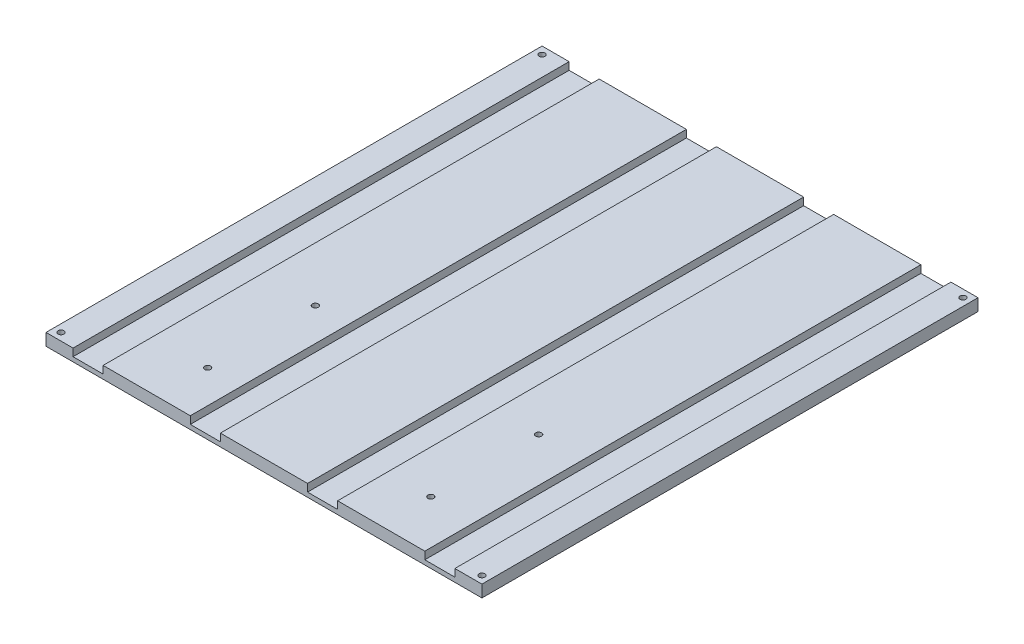
ISO-10303-21;
HEADER;
FILE_DESCRIPTION(('STEP AP214'),'2;1');
FILE_NAME('part.step','',(''),(''),'','','');
FILE_SCHEMA(('AUTOMOTIVE_DESIGN { 1 0 10303 214 1 1 1 1 }'));
ENDSEC;
DATA;
#1=APPLICATION_CONTEXT('core data for automotive mechanical design processes');
#2=APPLICATION_PROTOCOL_DEFINITION('international standard','automotive_design',2000,#1);
#3=PRODUCT_CONTEXT('',#1,'mechanical');
#4=PRODUCT('Part','Part','',(#3));
#5=PRODUCT_RELATED_PRODUCT_CATEGORY('part','',(#4));
#6=PRODUCT_DEFINITION_FORMATION('','',#4);
#7=PRODUCT_DEFINITION_CONTEXT('part definition',#1,'design');
#8=PRODUCT_DEFINITION('design','',#6,#7);
#9=PRODUCT_DEFINITION_SHAPE('','',#8);
#10=(LENGTH_UNIT() NAMED_UNIT(*) SI_UNIT(.MILLI.,.METRE.));
#11=(NAMED_UNIT(*) PLANE_ANGLE_UNIT() SI_UNIT($,.RADIAN.));
#12=(NAMED_UNIT(*) SI_UNIT($,.STERADIAN.) SOLID_ANGLE_UNIT());
#13=UNCERTAINTY_MEASURE_WITH_UNIT(LENGTH_MEASURE(1.E-05),#10,'distance_accuracy_value','');
#14=(GEOMETRIC_REPRESENTATION_CONTEXT(3) GLOBAL_UNCERTAINTY_ASSIGNED_CONTEXT((#13)) GLOBAL_UNIT_ASSIGNED_CONTEXT((#10,
#11,#12)) REPRESENTATION_CONTEXT('',''));
#15=CARTESIAN_POINT('',(0.,0.,0.));
#16=DIRECTION('',(0.,0.,1.));
#17=DIRECTION('',(1.,0.,0.));
#18=AXIS2_PLACEMENT_3D('',#15,#16,#17);
#19=CARTESIAN_POINT('',(-72.5,-4.,-82.5));
#20=DIRECTION('',(0.,0.,1.));
#21=DIRECTION('',(1.,0.,0.));
#22=AXIS2_PLACEMENT_3D('',#19,#20,#21);
#23=PLANE('',#22);
#24=DIRECTION('',(1.,0.,0.));
#25=VECTOR('',#24,1.);
#26=CARTESIAN_POINT('',(-63.5,-2.5,-82.5000000000001));
#27=LINE('',#26,#25);
#28=CARTESIAN_POINT('',(-63.5,-2.5,-82.5000000000001));
#29=VERTEX_POINT('',#28);
#30=CARTESIAN_POINT('',(-53.5,-2.5,-82.5000000000001));
#31=VERTEX_POINT('',#30);
#32=EDGE_CURVE('E196',#29,#31,#27,.T.);
#33=ORIENTED_EDGE('',*,*,#32,.T.);
#34=DIRECTION('',(0.,1.,0.));
#35=VECTOR('',#34,1.);
#36=CARTESIAN_POINT('',(-53.5,-2.5,-82.5000000000001));
#37=LINE('',#36,#35);
#38=CARTESIAN_POINT('',(-53.5,0.,-82.5000000000001));
#39=VERTEX_POINT('',#38);
#40=EDGE_CURVE('E178',#31,#39,#37,.T.);
#41=ORIENTED_EDGE('',*,*,#40,.T.);
#42=DIRECTION('',(1.,0.,0.));
#43=VECTOR('',#42,1.);
#44=CARTESIAN_POINT('',(-72.5,0.,-82.5));
#45=LINE('',#44,#43);
#46=CARTESIAN_POINT('',(-24.5,0.,-82.5000000000001));
#47=VERTEX_POINT('',#46);
#48=EDGE_CURVE('E312',#39,#47,#45,.T.);
#49=ORIENTED_EDGE('',*,*,#48,.T.);
#50=DIRECTION('',(0.,1.,0.));
#51=VECTOR('',#50,1.);
#52=CARTESIAN_POINT('',(-24.5,-2.5,-82.5000000000001));
#53=LINE('',#52,#51);
#54=CARTESIAN_POINT('',(-24.5,-2.5,-82.5000000000001));
#55=VERTEX_POINT('',#54);
#56=EDGE_CURVE('E228',#55,#47,#53,.T.);
#57=ORIENTED_EDGE('',*,*,#56,.F.);
#58=DIRECTION('',(1.,0.,0.));
#59=VECTOR('',#58,1.);
#60=CARTESIAN_POINT('',(-24.5,-2.5,-82.5000000000001));
#61=LINE('',#60,#59);
#62=CARTESIAN_POINT('',(-14.5,-2.5,-82.5000000000001));
#63=VERTEX_POINT('',#62);
#64=EDGE_CURVE('E240',#55,#63,#61,.T.);
#65=ORIENTED_EDGE('',*,*,#64,.T.);
#66=DIRECTION('',(0.,1.,0.));
#67=VECTOR('',#66,1.);
#68=CARTESIAN_POINT('',(-14.5,-2.5,-82.5000000000001));
#69=LINE('',#68,#67);
#70=CARTESIAN_POINT('',(-14.5,0.,-82.5000000000001));
#71=VERTEX_POINT('',#70);
#72=EDGE_CURVE('E225',#63,#71,#69,.T.);
#73=ORIENTED_EDGE('',*,*,#72,.T.);
#74=CARTESIAN_POINT('',(14.5,0.,-82.5000000000001));
#75=VERTEX_POINT('',#74);
#76=EDGE_CURVE('E413',#71,#75,#45,.T.);
#77=ORIENTED_EDGE('',*,*,#76,.T.);
#78=DIRECTION('',(0.,1.,0.));
#79=VECTOR('',#78,1.);
#80=CARTESIAN_POINT('',(14.5,-2.5,-82.5000000000001));
#81=LINE('',#80,#79);
#82=CARTESIAN_POINT('',(14.5,-2.5,-82.5000000000001));
#83=VERTEX_POINT('',#82);
#84=EDGE_CURVE('E253',#83,#75,#81,.T.);
#85=ORIENTED_EDGE('',*,*,#84,.F.);
#86=DIRECTION('',(1.,0.,0.));
#87=VECTOR('',#86,1.);
#88=CARTESIAN_POINT('',(14.5,-2.5,-82.5000000000001));
#89=LINE('',#88,#87);
#90=CARTESIAN_POINT('',(24.5,-2.5,-82.5000000000001));
#91=VERTEX_POINT('',#90);
#92=EDGE_CURVE('E265',#83,#91,#89,.T.);
#93=ORIENTED_EDGE('',*,*,#92,.T.);
#94=DIRECTION('',(0.,1.,0.));
#95=VECTOR('',#94,1.);
#96=CARTESIAN_POINT('',(24.5,-2.5,-82.5000000000001));
#97=LINE('',#96,#95);
#98=CARTESIAN_POINT('',(24.5,0.,-82.5000000000001));
#99=VERTEX_POINT('',#98);
#100=EDGE_CURVE('E250',#91,#99,#97,.T.);
#101=ORIENTED_EDGE('',*,*,#100,.T.);
#102=CARTESIAN_POINT('',(53.5,0.,-82.5000000000001));
#103=VERTEX_POINT('',#102);
#104=EDGE_CURVE('E411',#99,#103,#45,.T.);
#105=ORIENTED_EDGE('',*,*,#104,.T.);
#106=DIRECTION('',(0.,1.,0.));
#107=VECTOR('',#106,1.);
#108=CARTESIAN_POINT('',(53.5,-2.5,-82.5000000000001));
#109=LINE('',#108,#107);
#110=CARTESIAN_POINT('',(53.5,-2.5,-82.5000000000001));
#111=VERTEX_POINT('',#110);
#112=EDGE_CURVE('E278',#111,#103,#109,.T.);
#113=ORIENTED_EDGE('',*,*,#112,.F.);
#114=DIRECTION('',(1.,0.,0.));
#115=VECTOR('',#114,1.);
#116=CARTESIAN_POINT('',(53.5,-2.5,-82.5000000000001));
#117=LINE('',#116,#115);
#118=CARTESIAN_POINT('',(63.5,-2.5,-82.5000000000001));
#119=VERTEX_POINT('',#118);
#120=EDGE_CURVE('E289',#111,#119,#117,.T.);
#121=ORIENTED_EDGE('',*,*,#120,.T.);
#122=DIRECTION('',(0.,1.,0.));
#123=VECTOR('',#122,1.);
#124=CARTESIAN_POINT('',(63.5,-2.5,-82.5000000000001));
#125=LINE('',#124,#123);
#126=CARTESIAN_POINT('',(63.5,0.,-82.5000000000001));
#127=VERTEX_POINT('',#126);
#128=EDGE_CURVE('E275',#119,#127,#125,.T.);
#129=ORIENTED_EDGE('',*,*,#128,.T.);
#130=CARTESIAN_POINT('',(72.5,0.,-82.5));
#131=VERTEX_POINT('',#130);
#132=EDGE_CURVE('E189',#127,#131,#45,.T.);
#133=ORIENTED_EDGE('',*,*,#132,.T.);
#134=DIRECTION('',(0.,1.,0.));
#135=VECTOR('',#134,1.);
#136=CARTESIAN_POINT('',(72.5,-4.,-82.5));
#137=LINE('',#136,#135);
#138=CARTESIAN_POINT('',(72.5,-4.,-82.5));
#139=VERTEX_POINT('',#138);
#140=EDGE_CURVE('E11',#139,#131,#137,.T.);
#141=ORIENTED_EDGE('',*,*,#140,.F.);
#142=DIRECTION('',(1.,0.,0.));
#143=VECTOR('',#142,1.);
#144=CARTESIAN_POINT('',(-72.5,-4.,-82.5));
#145=LINE('',#144,#143);
#146=CARTESIAN_POINT('',(-72.5,-4.,-82.5));
#147=VERTEX_POINT('',#146);
#148=EDGE_CURVE('E297',#147,#139,#145,.T.);
#149=ORIENTED_EDGE('',*,*,#148,.F.);
#150=DIRECTION('',(0.,1.,0.));
#151=VECTOR('',#150,1.);
#152=CARTESIAN_POINT('',(-72.5,-4.,-82.5));
#153=LINE('',#152,#151);
#154=CARTESIAN_POINT('',(-72.5,0.,-82.5));
#155=VERTEX_POINT('',#154);
#156=EDGE_CURVE('E308',#147,#155,#153,.T.);
#157=ORIENTED_EDGE('',*,*,#156,.T.);
#158=CARTESIAN_POINT('',(-63.5,0.,-82.5));
#159=VERTEX_POINT('',#158);
#160=EDGE_CURVE('E309',#155,#159,#45,.T.);
#161=ORIENTED_EDGE('',*,*,#160,.T.);
#162=DIRECTION('',(0.,1.,0.));
#163=VECTOR('',#162,1.);
#164=CARTESIAN_POINT('',(-63.5,-2.5,-82.5000000000001));
#165=LINE('',#164,#163);
#166=EDGE_CURVE('E203',#29,#159,#165,.T.);
#167=ORIENTED_EDGE('',*,*,#166,.F.);
#168=EDGE_LOOP('',(#33,#41,#49,#57,#65,#73,#77,#85,#93,#101,#105,#113,#121,#129,#133,#141,#149,
#157,#161,#167));
#169=FACE_BOUND('',#168,.T.);
#170=ADVANCED_FACE('F41',(#169),#23,.F.);
#171=CARTESIAN_POINT('',(-72.5,-4.,82.5));
#172=DIRECTION('',(0.,0.,1.));
#173=DIRECTION('',(1.,0.,0.));
#174=AXIS2_PLACEMENT_3D('',#171,#172,#173);
#175=PLANE('',#174);
#176=DIRECTION('',(0.,1.,0.));
#177=VECTOR('',#176,1.);
#178=CARTESIAN_POINT('',(-53.5,-2.5,82.4999999999999));
#179=LINE('',#178,#177);
#180=CARTESIAN_POINT('',(-53.5,-2.5,82.4999999999999));
#181=VERTEX_POINT('',#180);
#182=CARTESIAN_POINT('',(-53.5,0.,82.4999999999999));
#183=VERTEX_POINT('',#182);
#184=EDGE_CURVE('E190',#181,#183,#179,.T.);
#185=ORIENTED_EDGE('',*,*,#184,.F.);
#186=DIRECTION('',(1.,0.,0.));
#187=VECTOR('',#186,1.);
#188=CARTESIAN_POINT('',(-63.5,-2.5,82.4999999999999));
#189=LINE('',#188,#187);
#190=CARTESIAN_POINT('',(-63.5,-2.5,82.4999999999999));
#191=VERTEX_POINT('',#190);
#192=EDGE_CURVE('E199',#191,#181,#189,.T.);
#193=ORIENTED_EDGE('',*,*,#192,.F.);
#194=DIRECTION('',(0.,1.,0.));
#195=VECTOR('',#194,1.);
#196=CARTESIAN_POINT('',(-63.5,-2.5,82.4999999999999));
#197=LINE('',#196,#195);
#198=CARTESIAN_POINT('',(-63.5,0.,82.4999999999999));
#199=VERTEX_POINT('',#198);
#200=EDGE_CURVE('E218',#191,#199,#197,.T.);
#201=ORIENTED_EDGE('',*,*,#200,.T.);
#202=DIRECTION('',(1.,0.,0.));
#203=VECTOR('',#202,1.);
#204=CARTESIAN_POINT('',(-72.5,0.,82.5));
#205=LINE('',#204,#203);
#206=CARTESIAN_POINT('',(-72.5,0.,82.5));
#207=VERTEX_POINT('',#206);
#208=EDGE_CURVE('E316',#207,#199,#205,.T.);
#209=ORIENTED_EDGE('',*,*,#208,.F.);
#210=DIRECTION('',(0.,1.,0.));
#211=VECTOR('',#210,1.);
#212=CARTESIAN_POINT('',(-72.5,-4.,82.5));
#213=LINE('',#212,#211);
#214=CARTESIAN_POINT('',(-72.5,-4.,82.5));
#215=VERTEX_POINT('',#214);
#216=EDGE_CURVE('E323',#215,#207,#213,.T.);
#217=ORIENTED_EDGE('',*,*,#216,.F.);
#218=DIRECTION('',(1.,0.,0.));
#219=VECTOR('',#218,1.);
#220=CARTESIAN_POINT('',(-72.5,-4.,82.5));
#221=LINE('',#220,#219);
#222=CARTESIAN_POINT('',(72.5,-4.,82.5));
#223=VERTEX_POINT('',#222);
#224=EDGE_CURVE('E303',#215,#223,#221,.T.);
#225=ORIENTED_EDGE('',*,*,#224,.T.);
#226=DIRECTION('',(0.,1.,0.));
#227=VECTOR('',#226,1.);
#228=CARTESIAN_POINT('',(72.5,-4.,82.5));
#229=LINE('',#228,#227);
#230=CARTESIAN_POINT('',(72.5,0.,82.5));
#231=VERTEX_POINT('',#230);
#232=EDGE_CURVE('E49',#223,#231,#229,.T.);
#233=ORIENTED_EDGE('',*,*,#232,.T.);
#234=CARTESIAN_POINT('',(63.5,0.,82.5));
#235=VERTEX_POINT('',#234);
#236=EDGE_CURVE('E315',#235,#231,#205,.T.);
#237=ORIENTED_EDGE('',*,*,#236,.F.);
#238=DIRECTION('',(0.,1.,0.));
#239=VECTOR('',#238,1.);
#240=CARTESIAN_POINT('',(63.5,-2.5,82.4999999999999));
#241=LINE('',#240,#239);
#242=CARTESIAN_POINT('',(63.5,-2.5,82.4999999999999));
#243=VERTEX_POINT('',#242);
#244=EDGE_CURVE('E57',#243,#235,#241,.T.);
#245=ORIENTED_EDGE('',*,*,#244,.F.);
#246=DIRECTION('',(1.,0.,0.));
#247=VECTOR('',#246,1.);
#248=CARTESIAN_POINT('',(53.5,-2.5,82.4999999999999));
#249=LINE('',#248,#247);
#250=CARTESIAN_POINT('',(53.5,-2.5,82.4999999999999));
#251=VERTEX_POINT('',#250);
#252=EDGE_CURVE('E286',#251,#243,#249,.T.);
#253=ORIENTED_EDGE('',*,*,#252,.F.);
#254=DIRECTION('',(0.,1.,0.));
#255=VECTOR('',#254,1.);
#256=CARTESIAN_POINT('',(53.5,-2.5,82.4999999999999));
#257=LINE('',#256,#255);
#258=CARTESIAN_POINT('',(53.5,0.,82.4999999999999));
#259=VERTEX_POINT('',#258);
#260=EDGE_CURVE('E280',#251,#259,#257,.T.);
#261=ORIENTED_EDGE('',*,*,#260,.T.);
#262=CARTESIAN_POINT('',(24.5,0.,82.5));
#263=VERTEX_POINT('',#262);
#264=EDGE_CURVE('E406',#263,#259,#205,.T.);
#265=ORIENTED_EDGE('',*,*,#264,.F.);
#266=DIRECTION('',(0.,1.,0.));
#267=VECTOR('',#266,1.);
#268=CARTESIAN_POINT('',(24.5,-2.5,82.4999999999999));
#269=LINE('',#268,#267);
#270=CARTESIAN_POINT('',(24.5,-2.5,82.4999999999999));
#271=VERTEX_POINT('',#270);
#272=EDGE_CURVE('E65',#271,#263,#269,.T.);
#273=ORIENTED_EDGE('',*,*,#272,.F.);
#274=DIRECTION('',(1.,0.,0.));
#275=VECTOR('',#274,1.);
#276=CARTESIAN_POINT('',(14.5,-2.5,82.4999999999999));
#277=LINE('',#276,#275);
#278=CARTESIAN_POINT('',(14.5,-2.5,82.4999999999999));
#279=VERTEX_POINT('',#278);
#280=EDGE_CURVE('E262',#279,#271,#277,.T.);
#281=ORIENTED_EDGE('',*,*,#280,.F.);
#282=DIRECTION('',(0.,1.,0.));
#283=VECTOR('',#282,1.);
#284=CARTESIAN_POINT('',(14.5,-2.5,82.4999999999999));
#285=LINE('',#284,#283);
#286=CARTESIAN_POINT('',(14.5,0.,82.4999999999999));
#287=VERTEX_POINT('',#286);
#288=EDGE_CURVE('E255',#279,#287,#285,.T.);
#289=ORIENTED_EDGE('',*,*,#288,.T.);
#290=CARTESIAN_POINT('',(-14.5,0.,82.5));
#291=VERTEX_POINT('',#290);
#292=EDGE_CURVE('E435',#291,#287,#205,.T.);
#293=ORIENTED_EDGE('',*,*,#292,.F.);
#294=DIRECTION('',(0.,1.,0.));
#295=VECTOR('',#294,1.);
#296=CARTESIAN_POINT('',(-14.5,-2.5,82.4999999999999));
#297=LINE('',#296,#295);
#298=CARTESIAN_POINT('',(-14.5,-2.5,82.4999999999999));
#299=VERTEX_POINT('',#298);
#300=EDGE_CURVE('E222',#299,#291,#297,.T.);
#301=ORIENTED_EDGE('',*,*,#300,.F.);
#302=DIRECTION('',(1.,0.,0.));
#303=VECTOR('',#302,1.);
#304=CARTESIAN_POINT('',(-24.5,-2.5,82.4999999999999));
#305=LINE('',#304,#303);
#306=CARTESIAN_POINT('',(-24.5,-2.5,82.4999999999999));
#307=VERTEX_POINT('',#306);
#308=EDGE_CURVE('E237',#307,#299,#305,.T.);
#309=ORIENTED_EDGE('',*,*,#308,.F.);
#310=DIRECTION('',(0.,1.,0.));
#311=VECTOR('',#310,1.);
#312=CARTESIAN_POINT('',(-24.5,-2.5,82.4999999999999));
#313=LINE('',#312,#311);
#314=CARTESIAN_POINT('',(-24.5,0.,82.4999999999999));
#315=VERTEX_POINT('',#314);
#316=EDGE_CURVE('E230',#307,#315,#313,.T.);
#317=ORIENTED_EDGE('',*,*,#316,.T.);
#318=EDGE_CURVE('E319',#183,#315,#205,.T.);
#319=ORIENTED_EDGE('',*,*,#318,.F.);
#320=EDGE_LOOP('',(#185,#193,#201,#209,#217,#225,#233,#237,#245,#253,#261,#265,#273,#281,#289,
#293,#301,#309,#317,#319));
#321=FACE_BOUND('',#320,.T.);
#322=ADVANCED_FACE('F357',(#321),#175,.T.);
#323=CARTESIAN_POINT('',(0.,0.,0.));
#324=DIRECTION('',(0.,1.,0.));
#325=DIRECTION('',(0.,0.,1.));
#326=AXIS2_PLACEMENT_3D('',#323,#324,#325);
#327=PLANE('',#326);
#328=CARTESIAN_POINT('',(-70.,0.,80.));
#329=DIRECTION('',(0.,1.,0.));
#330=DIRECTION('',(0.,0.,1.));
#331=AXIS2_PLACEMENT_3D('',#328,#329,#330);
#332=CIRCLE('',#331,0.97999999999999);
#333=CARTESIAN_POINT('',(-70.,0.,80.98));
#334=VERTEX_POINT('',#333);
#335=EDGE_CURVE('E209',#334,#334,#332,.T.);
#336=ORIENTED_EDGE('',*,*,#335,.F.);
#337=EDGE_LOOP('',(#336));
#338=FACE_BOUND('',#337,.T.);
#339=CARTESIAN_POINT('',(-70.,0.,-80.));
#340=DIRECTION('',(0.,1.,0.));
#341=DIRECTION('',(0.,0.,1.));
#342=AXIS2_PLACEMENT_3D('',#339,#340,#341);
#343=CIRCLE('',#342,0.97999999999999);
#344=CARTESIAN_POINT('',(-70.,0.,-79.02));
#345=VERTEX_POINT('',#344);
#346=EDGE_CURVE('E332',#345,#345,#343,.T.);
#347=ORIENTED_EDGE('',*,*,#346,.F.);
#348=EDGE_LOOP('',(#347));
#349=FACE_BOUND('',#348,.T.);
#350=ORIENTED_EDGE('',*,*,#208,.T.);
#351=DIRECTION('',(0.,0.,-1.));
#352=VECTOR('',#351,1.);
#353=CARTESIAN_POINT('',(-63.5,0.,82.4999999999999));
#354=LINE('',#353,#352);
#355=EDGE_CURVE('E204',#199,#159,#354,.T.);
#356=ORIENTED_EDGE('',*,*,#355,.T.);
#357=ORIENTED_EDGE('',*,*,#160,.F.);
#358=DIRECTION('',(0.,0.,-1.));
#359=VECTOR('',#358,1.);
#360=CARTESIAN_POINT('',(-72.5,0.,82.5));
#361=LINE('',#360,#359);
#362=EDGE_CURVE('E300',#207,#155,#361,.T.);
#363=ORIENTED_EDGE('',*,*,#362,.F.);
#364=EDGE_LOOP('',(#350,#356,#357,#363));
#365=FACE_BOUND('',#364,.T.);
#366=ADVANCED_FACE('F353',(#338,#349,#365),#327,.T.);
#367=CARTESIAN_POINT('',(-35.4387355213286,0.,65.8118093505721));
#368=DIRECTION('',(0.,1.,0.));
#369=DIRECTION('',(0.,0.,1.));
#370=AXIS2_PLACEMENT_3D('',#367,#368,#369);
#371=CIRCLE('',#370,0.980000000000004);
#372=CARTESIAN_POINT('',(-35.4387355213286,0.,66.7918093505721));
#373=VERTEX_POINT('',#372);
#374=EDGE_CURVE('E494',#373,#373,#371,.T.);
#375=ORIENTED_EDGE('',*,*,#374,.F.);
#376=EDGE_LOOP('',(#375));
#377=FACE_BOUND('',#376,.T.);
#378=CARTESIAN_POINT('',(-35.4387355213286,0.,29.9718093505721));
#379=DIRECTION('',(0.,1.,0.));
#380=DIRECTION('',(0.,0.,1.));
#381=AXIS2_PLACEMENT_3D('',#378,#379,#380);
#382=CIRCLE('',#381,0.980000000000012);
#383=CARTESIAN_POINT('',(-35.4387355213286,0.,30.9518093505721));
#384=VERTEX_POINT('',#383);
#385=EDGE_CURVE('E483',#384,#384,#382,.T.);
#386=ORIENTED_EDGE('',*,*,#385,.F.);
#387=EDGE_LOOP('',(#386));
#388=FACE_BOUND('',#387,.T.);
#389=DIRECTION('',(0.,0.,-1.));
#390=VECTOR('',#389,1.);
#391=CARTESIAN_POINT('',(-53.5,0.,82.4999999999999));
#392=LINE('',#391,#390);
#393=EDGE_CURVE('E184',#183,#39,#392,.T.);
#394=ORIENTED_EDGE('',*,*,#393,.F.);
#395=ORIENTED_EDGE('',*,*,#318,.T.);
#396=DIRECTION('',(0.,0.,-1.));
#397=VECTOR('',#396,1.);
#398=CARTESIAN_POINT('',(-24.5,0.,82.4999999999999));
#399=LINE('',#398,#397);
#400=EDGE_CURVE('E234',#315,#47,#399,.T.);
#401=ORIENTED_EDGE('',*,*,#400,.T.);
#402=ORIENTED_EDGE('',*,*,#48,.F.);
#403=EDGE_LOOP('',(#394,#395,#401,#402));
#404=FACE_BOUND('',#403,.T.);
#405=ADVANCED_FACE('F356',(#377,#388,#404),#327,.T.);
#406=DIRECTION('',(0.,0.,-1.));
#407=VECTOR('',#406,1.);
#408=CARTESIAN_POINT('',(-14.5,0.,82.4999999999999));
#409=LINE('',#408,#407);
#410=EDGE_CURVE('E215',#291,#71,#409,.T.);
#411=ORIENTED_EDGE('',*,*,#410,.F.);
#412=ORIENTED_EDGE('',*,*,#292,.T.);
#413=DIRECTION('',(0.,0.,-1.));
#414=VECTOR('',#413,1.);
#415=CARTESIAN_POINT('',(14.5,0.,82.4999999999999));
#416=LINE('',#415,#414);
#417=EDGE_CURVE('E259',#287,#75,#416,.T.);
#418=ORIENTED_EDGE('',*,*,#417,.T.);
#419=ORIENTED_EDGE('',*,*,#76,.F.);
#420=EDGE_LOOP('',(#411,#412,#418,#419));
#421=FACE_BOUND('',#420,.T.);
#422=ADVANCED_FACE('F398',(#421),#327,.T.);
#423=CARTESIAN_POINT('',(38.8312644786714,0.,65.8118093505721));
#424=DIRECTION('',(0.,1.,0.));
#425=DIRECTION('',(0.,0.,1.));
#426=AXIS2_PLACEMENT_3D('',#423,#424,#425);
#427=CIRCLE('',#426,0.979999999999997);
#428=CARTESIAN_POINT('',(38.8312644786714,0.,66.7918093505721));
#429=VERTEX_POINT('',#428);
#430=EDGE_CURVE('E500',#429,#429,#427,.T.);
#431=ORIENTED_EDGE('',*,*,#430,.F.);
#432=EDGE_LOOP('',(#431));
#433=FACE_BOUND('',#432,.T.);
#434=CARTESIAN_POINT('',(38.8312644786714,0.,29.9718093505721));
#435=DIRECTION('',(0.,1.,0.));
#436=DIRECTION('',(0.,0.,1.));
#437=AXIS2_PLACEMENT_3D('',#434,#435,#436);
#438=CIRCLE('',#437,0.979999999999997);
#439=CARTESIAN_POINT('',(38.8312644786714,0.,30.9518093505721));
#440=VERTEX_POINT('',#439);
#441=EDGE_CURVE('E506',#440,#440,#438,.T.);
#442=ORIENTED_EDGE('',*,*,#441,.F.);
#443=EDGE_LOOP('',(#442));
#444=FACE_BOUND('',#443,.T.);
#445=DIRECTION('',(0.,0.,-1.));
#446=VECTOR('',#445,1.);
#447=CARTESIAN_POINT('',(24.5,0.,82.4999999999999));
#448=LINE('',#447,#446);
#449=EDGE_CURVE('E233',#263,#99,#448,.T.);
#450=ORIENTED_EDGE('',*,*,#449,.F.);
#451=ORIENTED_EDGE('',*,*,#264,.T.);
#452=DIRECTION('',(0.,0.,-1.));
#453=VECTOR('',#452,1.);
#454=CARTESIAN_POINT('',(53.5,0.,82.4999999999999));
#455=LINE('',#454,#453);
#456=EDGE_CURVE('E283',#259,#103,#455,.T.);
#457=ORIENTED_EDGE('',*,*,#456,.T.);
#458=ORIENTED_EDGE('',*,*,#104,.F.);
#459=EDGE_LOOP('',(#450,#451,#457,#458));
#460=FACE_BOUND('',#459,.T.);
#461=ADVANCED_FACE('F391',(#433,#444,#460),#327,.T.);
#462=CARTESIAN_POINT('',(72.5,-4.,82.5));
#463=DIRECTION('',(1.,0.,0.));
#464=DIRECTION('',(0.,0.,-1.));
#465=AXIS2_PLACEMENT_3D('',#462,#463,#464);
#466=PLANE('',#465);
#467=DIRECTION('',(0.,0.,-1.));
#468=VECTOR('',#467,1.);
#469=CARTESIAN_POINT('',(72.5,0.,82.5));
#470=LINE('',#469,#468);
#471=EDGE_CURVE('E311',#231,#131,#470,.T.);
#472=ORIENTED_EDGE('',*,*,#471,.F.);
#473=ORIENTED_EDGE('',*,*,#232,.F.);
#474=DIRECTION('',(0.,0.,-1.));
#475=VECTOR('',#474,1.);
#476=CARTESIAN_POINT('',(72.5,-4.,82.5));
#477=LINE('',#476,#475);
#478=EDGE_CURVE('E299',#223,#139,#477,.T.);
#479=ORIENTED_EDGE('',*,*,#478,.T.);
#480=ORIENTED_EDGE('',*,*,#140,.T.);
#481=EDGE_LOOP('',(#472,#473,#479,#480));
#482=FACE_BOUND('',#481,.T.);
#483=ADVANCED_FACE('F389',(#482),#466,.T.);
#484=CARTESIAN_POINT('',(-72.5,-4.,82.5));
#485=DIRECTION('',(1.,0.,0.));
#486=DIRECTION('',(0.,0.,-1.));
#487=AXIS2_PLACEMENT_3D('',#484,#485,#486);
#488=PLANE('',#487);
#489=ORIENTED_EDGE('',*,*,#362,.T.);
#490=ORIENTED_EDGE('',*,*,#156,.F.);
#491=DIRECTION('',(0.,0.,-1.));
#492=VECTOR('',#491,1.);
#493=CARTESIAN_POINT('',(-72.5,-4.,82.5));
#494=LINE('',#493,#492);
#495=EDGE_CURVE('E306',#215,#147,#494,.T.);
#496=ORIENTED_EDGE('',*,*,#495,.F.);
#497=ORIENTED_EDGE('',*,*,#216,.T.);
#498=EDGE_LOOP('',(#489,#490,#496,#497));
#499=FACE_BOUND('',#498,.T.);
#500=ADVANCED_FACE('F388',(#499),#488,.F.);
#501=CARTESIAN_POINT('',(0.,-4.,0.));
#502=DIRECTION('',(0.,1.,0.));
#503=DIRECTION('',(0.,0.,1.));
#504=AXIS2_PLACEMENT_3D('',#501,#502,#503);
#505=PLANE('',#504);
#506=CARTESIAN_POINT('',(-35.4387355213286,-4.,65.8118093505721));
#507=DIRECTION('',(0.,1.,0.));
#508=DIRECTION('',(0.,0.,1.));
#509=AXIS2_PLACEMENT_3D('',#506,#507,#508);
#510=CIRCLE('',#509,0.980000000000004);
#511=CARTESIAN_POINT('',(-35.4387355213286,-4.,66.7918093505721));
#512=VERTEX_POINT('',#511);
#513=EDGE_CURVE('E497',#512,#512,#510,.T.);
#514=ORIENTED_EDGE('',*,*,#513,.T.);
#515=EDGE_LOOP('',(#514));
#516=FACE_BOUND('',#515,.T.);
#517=CARTESIAN_POINT('',(38.8312644786714,-4.,65.8118093505721));
#518=DIRECTION('',(0.,1.,0.));
#519=DIRECTION('',(0.,0.,1.));
#520=AXIS2_PLACEMENT_3D('',#517,#518,#519);
#521=CIRCLE('',#520,0.979999999999997);
#522=CARTESIAN_POINT('',(38.8312644786714,-4.,66.7918093505721));
#523=VERTEX_POINT('',#522);
#524=EDGE_CURVE('E503',#523,#523,#521,.T.);
#525=ORIENTED_EDGE('',*,*,#524,.T.);
#526=EDGE_LOOP('',(#525));
#527=FACE_BOUND('',#526,.T.);
#528=CARTESIAN_POINT('',(38.8312644786714,-4.,29.9718093505721));
#529=DIRECTION('',(0.,1.,0.));
#530=DIRECTION('',(0.,0.,1.));
#531=AXIS2_PLACEMENT_3D('',#528,#529,#530);
#532=CIRCLE('',#531,0.979999999999997);
#533=CARTESIAN_POINT('',(38.8312644786714,-4.,30.9518093505721));
#534=VERTEX_POINT('',#533);
#535=EDGE_CURVE('E491',#534,#534,#532,.T.);
#536=ORIENTED_EDGE('',*,*,#535,.T.);
#537=EDGE_LOOP('',(#536));
#538=FACE_BOUND('',#537,.T.);
#539=CARTESIAN_POINT('',(-35.4387355213286,-4.,29.9718093505721));
#540=DIRECTION('',(0.,1.,0.));
#541=DIRECTION('',(0.,0.,1.));
#542=AXIS2_PLACEMENT_3D('',#539,#540,#541);
#543=CIRCLE('',#542,0.980000000000012);
#544=CARTESIAN_POINT('',(-35.4387355213286,-4.,30.9518093505721));
#545=VERTEX_POINT('',#544);
#546=EDGE_CURVE('E486',#545,#545,#543,.T.);
#547=ORIENTED_EDGE('',*,*,#546,.T.);
#548=EDGE_LOOP('',(#547));
#549=FACE_BOUND('',#548,.T.);
#550=CARTESIAN_POINT('',(70.,-4.,80.));
#551=DIRECTION('',(0.,-1.,0.));
#552=DIRECTION('',(0.,0.,-1.));
#553=AXIS2_PLACEMENT_3D('',#550,#551,#552);
#554=CIRCLE('',#553,0.97999999999999);
#555=CARTESIAN_POINT('',(70.,-4.,79.02));
#556=VERTEX_POINT('',#555);
#557=EDGE_CURVE('E342',#556,#556,#554,.T.);
#558=ORIENTED_EDGE('',*,*,#557,.F.);
#559=EDGE_LOOP('',(#558));
#560=FACE_BOUND('',#559,.T.);
#561=CARTESIAN_POINT('',(-70.,-4.,80.));
#562=DIRECTION('',(0.,-1.,0.));
#563=DIRECTION('',(0.,0.,-1.));
#564=AXIS2_PLACEMENT_3D('',#561,#562,#563);
#565=CIRCLE('',#564,0.97999999999999);
#566=CARTESIAN_POINT('',(-70.,-4.,79.02));
#567=VERTEX_POINT('',#566);
#568=EDGE_CURVE('E339',#567,#567,#565,.T.);
#569=ORIENTED_EDGE('',*,*,#568,.F.);
#570=EDGE_LOOP('',(#569));
#571=FACE_BOUND('',#570,.T.);
#572=CARTESIAN_POINT('',(-70.,-4.,-80.));
#573=DIRECTION('',(0.,-1.,0.));
#574=DIRECTION('',(0.,0.,-1.));
#575=AXIS2_PLACEMENT_3D('',#572,#573,#574);
#576=CIRCLE('',#575,0.97999999999999);
#577=CARTESIAN_POINT('',(-70.,-4.,-80.98));
#578=VERTEX_POINT('',#577);
#579=EDGE_CURVE('E334',#578,#578,#576,.T.);
#580=ORIENTED_EDGE('',*,*,#579,.F.);
#581=EDGE_LOOP('',(#580));
#582=FACE_BOUND('',#581,.T.);
#583=CARTESIAN_POINT('',(70.,-4.,-80.));
#584=DIRECTION('',(0.,-1.,0.));
#585=DIRECTION('',(0.,0.,-1.));
#586=AXIS2_PLACEMENT_3D('',#583,#584,#585);
#587=CIRCLE('',#586,0.97999999999999);
#588=CARTESIAN_POINT('',(70.,-4.,-80.98));
#589=VERTEX_POINT('',#588);
#590=EDGE_CURVE('E328',#589,#589,#587,.T.);
#591=ORIENTED_EDGE('',*,*,#590,.F.);
#592=EDGE_LOOP('',(#591));
#593=FACE_BOUND('',#592,.T.);
#594=ORIENTED_EDGE('',*,*,#148,.T.);
#595=ORIENTED_EDGE('',*,*,#478,.F.);
#596=ORIENTED_EDGE('',*,*,#224,.F.);
#597=ORIENTED_EDGE('',*,*,#495,.T.);
#598=EDGE_LOOP('',(#594,#595,#596,#597));
#599=FACE_BOUND('',#598,.T.);
#600=ADVANCED_FACE('F395',(#516,#527,#538,#549,#560,#571,#582,#593,#599),#505,.F.);
#601=CARTESIAN_POINT('',(70.,0.,80.));
#602=DIRECTION('',(0.,1.,0.));
#603=DIRECTION('',(0.,0.,1.));
#604=AXIS2_PLACEMENT_3D('',#601,#602,#603);
#605=CIRCLE('',#604,0.97999999999999);
#606=CARTESIAN_POINT('',(70.,0.,80.98));
#607=VERTEX_POINT('',#606);
#608=EDGE_CURVE('E44',#607,#607,#605,.T.);
#609=ORIENTED_EDGE('',*,*,#608,.F.);
#610=EDGE_LOOP('',(#609));
#611=FACE_BOUND('',#610,.T.);
#612=CARTESIAN_POINT('',(70.,0.,-80.));
#613=DIRECTION('',(0.,1.,0.));
#614=DIRECTION('',(0.,0.,1.));
#615=AXIS2_PLACEMENT_3D('',#612,#613,#614);
#616=CIRCLE('',#615,0.97999999999999);
#617=CARTESIAN_POINT('',(70.,0.,-79.02));
#618=VERTEX_POINT('',#617);
#619=EDGE_CURVE('E326',#618,#618,#616,.T.);
#620=ORIENTED_EDGE('',*,*,#619,.F.);
#621=EDGE_LOOP('',(#620));
#622=FACE_BOUND('',#621,.T.);
#623=DIRECTION('',(0.,0.,-1.));
#624=VECTOR('',#623,1.);
#625=CARTESIAN_POINT('',(63.5,0.,82.4999999999999));
#626=LINE('',#625,#624);
#627=EDGE_CURVE('E258',#235,#127,#626,.T.);
#628=ORIENTED_EDGE('',*,*,#627,.F.);
#629=ORIENTED_EDGE('',*,*,#236,.T.);
#630=ORIENTED_EDGE('',*,*,#471,.T.);
#631=ORIENTED_EDGE('',*,*,#132,.F.);
#632=EDGE_LOOP('',(#628,#629,#630,#631));
#633=FACE_BOUND('',#632,.T.);
#634=ADVANCED_FACE('F359',(#611,#622,#633),#327,.T.);
#635=CARTESIAN_POINT('',(53.5,-2.5,82.4999999999999));
#636=DIRECTION('',(1.,0.,0.));
#637=DIRECTION('',(0.,0.,-1.));
#638=AXIS2_PLACEMENT_3D('',#635,#636,#637);
#639=PLANE('',#638);
#640=ORIENTED_EDGE('',*,*,#456,.F.);
#641=ORIENTED_EDGE('',*,*,#260,.F.);
#642=DIRECTION('',(0.,0.,-1.));
#643=VECTOR('',#642,1.);
#644=CARTESIAN_POINT('',(53.5,-2.5,82.4999999999999));
#645=LINE('',#644,#643);
#646=EDGE_CURVE('E274',#251,#111,#645,.T.);
#647=ORIENTED_EDGE('',*,*,#646,.T.);
#648=ORIENTED_EDGE('',*,*,#112,.T.);
#649=EDGE_LOOP('',(#640,#641,#647,#648));
#650=FACE_BOUND('',#649,.T.);
#651=ADVANCED_FACE('F447',(#650),#639,.T.);
#652=CARTESIAN_POINT('',(63.5,-2.5,82.4999999999999));
#653=DIRECTION('',(1.,0.,0.));
#654=DIRECTION('',(0.,0.,-1.));
#655=AXIS2_PLACEMENT_3D('',#652,#653,#654);
#656=PLANE('',#655);
#657=ORIENTED_EDGE('',*,*,#627,.T.);
#658=ORIENTED_EDGE('',*,*,#128,.F.);
#659=DIRECTION('',(0.,0.,-1.));
#660=VECTOR('',#659,1.);
#661=CARTESIAN_POINT('',(63.5,-2.5,82.4999999999999));
#662=LINE('',#661,#660);
#663=EDGE_CURVE('E292',#243,#119,#662,.T.);
#664=ORIENTED_EDGE('',*,*,#663,.F.);
#665=ORIENTED_EDGE('',*,*,#244,.T.);
#666=EDGE_LOOP('',(#657,#658,#664,#665));
#667=FACE_BOUND('',#666,.T.);
#668=ADVANCED_FACE('F453',(#667),#656,.F.);
#669=CARTESIAN_POINT('',(0.,-2.5,0.));
#670=DIRECTION('',(0.,1.,0.));
#671=DIRECTION('',(0.,0.,1.));
#672=AXIS2_PLACEMENT_3D('',#669,#670,#671);
#673=PLANE('',#672);
#674=ORIENTED_EDGE('',*,*,#252,.T.);
#675=ORIENTED_EDGE('',*,*,#663,.T.);
#676=ORIENTED_EDGE('',*,*,#120,.F.);
#677=ORIENTED_EDGE('',*,*,#646,.F.);
#678=EDGE_LOOP('',(#674,#675,#676,#677));
#679=FACE_BOUND('',#678,.T.);
#680=ADVANCED_FACE('F451',(#679),#673,.T.);
#681=CARTESIAN_POINT('',(14.5,-2.5,82.4999999999999));
#682=DIRECTION('',(1.,0.,0.));
#683=DIRECTION('',(0.,0.,-1.));
#684=AXIS2_PLACEMENT_3D('',#681,#682,#683);
#685=PLANE('',#684);
#686=ORIENTED_EDGE('',*,*,#417,.F.);
#687=ORIENTED_EDGE('',*,*,#288,.F.);
#688=DIRECTION('',(0.,0.,-1.));
#689=VECTOR('',#688,1.);
#690=CARTESIAN_POINT('',(14.5,-2.5,82.4999999999999));
#691=LINE('',#690,#689);
#692=EDGE_CURVE('E249',#279,#83,#691,.T.);
#693=ORIENTED_EDGE('',*,*,#692,.T.);
#694=ORIENTED_EDGE('',*,*,#84,.T.);
#695=EDGE_LOOP('',(#686,#687,#693,#694));
#696=FACE_BOUND('',#695,.T.);
#697=ADVANCED_FACE('F437',(#696),#685,.T.);
#698=CARTESIAN_POINT('',(24.5,-2.5,82.4999999999999));
#699=DIRECTION('',(1.,0.,0.));
#700=DIRECTION('',(0.,0.,-1.));
#701=AXIS2_PLACEMENT_3D('',#698,#699,#700);
#702=PLANE('',#701);
#703=ORIENTED_EDGE('',*,*,#449,.T.);
#704=ORIENTED_EDGE('',*,*,#100,.F.);
#705=DIRECTION('',(0.,0.,-1.));
#706=VECTOR('',#705,1.);
#707=CARTESIAN_POINT('',(24.5,-2.5,82.4999999999999));
#708=LINE('',#707,#706);
#709=EDGE_CURVE('E268',#271,#91,#708,.T.);
#710=ORIENTED_EDGE('',*,*,#709,.F.);
#711=ORIENTED_EDGE('',*,*,#272,.T.);
#712=EDGE_LOOP('',(#703,#704,#710,#711));
#713=FACE_BOUND('',#712,.T.);
#714=ADVANCED_FACE('F643',(#713),#702,.F.);
#715=CARTESIAN_POINT('',(0.,-2.5,0.));
#716=DIRECTION('',(0.,1.,0.));
#717=DIRECTION('',(0.,0.,1.));
#718=AXIS2_PLACEMENT_3D('',#715,#716,#717);
#719=PLANE('',#718);
#720=ORIENTED_EDGE('',*,*,#280,.T.);
#721=ORIENTED_EDGE('',*,*,#709,.T.);
#722=ORIENTED_EDGE('',*,*,#92,.F.);
#723=ORIENTED_EDGE('',*,*,#692,.F.);
#724=EDGE_LOOP('',(#720,#721,#722,#723));
#725=FACE_BOUND('',#724,.T.);
#726=ADVANCED_FACE('F442',(#725),#719,.T.);
#727=CARTESIAN_POINT('',(-24.5,-2.5,82.4999999999999));
#728=DIRECTION('',(1.,0.,0.));
#729=DIRECTION('',(0.,0.,-1.));
#730=AXIS2_PLACEMENT_3D('',#727,#728,#729);
#731=PLANE('',#730);
#732=ORIENTED_EDGE('',*,*,#400,.F.);
#733=ORIENTED_EDGE('',*,*,#316,.F.);
#734=DIRECTION('',(0.,0.,-1.));
#735=VECTOR('',#734,1.);
#736=CARTESIAN_POINT('',(-24.5,-2.5,82.4999999999999));
#737=LINE('',#736,#735);
#738=EDGE_CURVE('E224',#307,#55,#737,.T.);
#739=ORIENTED_EDGE('',*,*,#738,.T.);
#740=ORIENTED_EDGE('',*,*,#56,.T.);
#741=EDGE_LOOP('',(#732,#733,#739,#740));
#742=FACE_BOUND('',#741,.T.);
#743=ADVANCED_FACE('F424',(#742),#731,.T.);
#744=CARTESIAN_POINT('',(-14.5,-2.5,82.4999999999999));
#745=DIRECTION('',(1.,0.,0.));
#746=DIRECTION('',(0.,0.,-1.));
#747=AXIS2_PLACEMENT_3D('',#744,#745,#746);
#748=PLANE('',#747);
#749=ORIENTED_EDGE('',*,*,#410,.T.);
#750=ORIENTED_EDGE('',*,*,#72,.F.);
#751=DIRECTION('',(0.,0.,-1.));
#752=VECTOR('',#751,1.);
#753=CARTESIAN_POINT('',(-14.5,-2.5,82.4999999999999));
#754=LINE('',#753,#752);
#755=EDGE_CURVE('E243',#299,#63,#754,.T.);
#756=ORIENTED_EDGE('',*,*,#755,.F.);
#757=ORIENTED_EDGE('',*,*,#300,.T.);
#758=EDGE_LOOP('',(#749,#750,#756,#757));
#759=FACE_BOUND('',#758,.T.);
#760=ADVANCED_FACE('F621',(#759),#748,.F.);
#761=CARTESIAN_POINT('',(0.,-2.5,0.));
#762=DIRECTION('',(0.,1.,0.));
#763=DIRECTION('',(0.,0.,1.));
#764=AXIS2_PLACEMENT_3D('',#761,#762,#763);
#765=PLANE('',#764);
#766=ORIENTED_EDGE('',*,*,#308,.T.);
#767=ORIENTED_EDGE('',*,*,#755,.T.);
#768=ORIENTED_EDGE('',*,*,#64,.F.);
#769=ORIENTED_EDGE('',*,*,#738,.F.);
#770=EDGE_LOOP('',(#766,#767,#768,#769));
#771=FACE_BOUND('',#770,.T.);
#772=ADVANCED_FACE('F376',(#771),#765,.T.);
#773=CARTESIAN_POINT('',(-53.5,-2.5,82.4999999999999));
#774=DIRECTION('',(1.,0.,0.));
#775=DIRECTION('',(0.,0.,-1.));
#776=AXIS2_PLACEMENT_3D('',#773,#774,#775);
#777=PLANE('',#776);
#778=ORIENTED_EDGE('',*,*,#393,.T.);
#779=ORIENTED_EDGE('',*,*,#40,.F.);
#780=DIRECTION('',(0.,0.,-1.));
#781=VECTOR('',#780,1.);
#782=CARTESIAN_POINT('',(-53.5,-2.5,82.4999999999999));
#783=LINE('',#782,#781);
#784=EDGE_CURVE('E181',#181,#31,#783,.T.);
#785=ORIENTED_EDGE('',*,*,#784,.F.);
#786=ORIENTED_EDGE('',*,*,#184,.T.);
#787=EDGE_LOOP('',(#778,#779,#785,#786));
#788=FACE_BOUND('',#787,.T.);
#789=ADVANCED_FACE('F180',(#788),#777,.F.);
#790=CARTESIAN_POINT('',(-63.5,-2.5,82.4999999999999));
#791=DIRECTION('',(1.,0.,0.));
#792=DIRECTION('',(0.,0.,-1.));
#793=AXIS2_PLACEMENT_3D('',#790,#791,#792);
#794=PLANE('',#793);
#795=ORIENTED_EDGE('',*,*,#355,.F.);
#796=ORIENTED_EDGE('',*,*,#200,.F.);
#797=DIRECTION('',(0.,0.,-1.));
#798=VECTOR('',#797,1.);
#799=CARTESIAN_POINT('',(-63.5,-2.5,82.4999999999999));
#800=LINE('',#799,#798);
#801=EDGE_CURVE('E213',#191,#29,#800,.T.);
#802=ORIENTED_EDGE('',*,*,#801,.T.);
#803=ORIENTED_EDGE('',*,*,#166,.T.);
#804=EDGE_LOOP('',(#795,#796,#802,#803));
#805=FACE_BOUND('',#804,.T.);
#806=ADVANCED_FACE('F367',(#805),#794,.T.);
#807=CARTESIAN_POINT('',(0.,-2.5,0.));
#808=DIRECTION('',(0.,1.,0.));
#809=DIRECTION('',(0.,0.,1.));
#810=AXIS2_PLACEMENT_3D('',#807,#808,#809);
#811=PLANE('',#810);
#812=ORIENTED_EDGE('',*,*,#32,.F.);
#813=ORIENTED_EDGE('',*,*,#801,.F.);
#814=ORIENTED_EDGE('',*,*,#192,.T.);
#815=ORIENTED_EDGE('',*,*,#784,.T.);
#816=EDGE_LOOP('',(#812,#813,#814,#815));
#817=FACE_BOUND('',#816,.T.);
#818=ADVANCED_FACE('F194',(#817),#811,.T.);
#819=CARTESIAN_POINT('',(70.,1.,-80.));
#820=DIRECTION('',(0.,-1.,0.));
#821=DIRECTION('',(0.,0.,-1.));
#822=AXIS2_PLACEMENT_3D('',#819,#820,#821);
#823=CYLINDRICAL_SURFACE('',#822,0.97999999999999);
#824=ORIENTED_EDGE('',*,*,#619,.T.);
#825=EDGE_LOOP('',(#824));
#826=FACE_BOUND('',#825,.T.);
#827=ORIENTED_EDGE('',*,*,#590,.T.);
#828=EDGE_LOOP('',(#827));
#829=FACE_BOUND('',#828,.T.);
#830=ADVANCED_FACE('F374',(#826,#829),#823,.F.);
#831=CARTESIAN_POINT('',(70.,1.,80.));
#832=DIRECTION('',(0.,-1.,0.));
#833=DIRECTION('',(0.,0.,-1.));
#834=AXIS2_PLACEMENT_3D('',#831,#832,#833);
#835=CYLINDRICAL_SURFACE('',#834,0.97999999999999);
#836=ORIENTED_EDGE('',*,*,#608,.T.);
#837=EDGE_LOOP('',(#836));
#838=FACE_BOUND('',#837,.T.);
#839=ORIENTED_EDGE('',*,*,#557,.T.);
#840=EDGE_LOOP('',(#839));
#841=FACE_BOUND('',#840,.T.);
#842=ADVANCED_FACE('F475',(#838,#841),#835,.F.);
#843=CARTESIAN_POINT('',(-70.,1.,-80.));
#844=DIRECTION('',(0.,-1.,0.));
#845=DIRECTION('',(0.,0.,-1.));
#846=AXIS2_PLACEMENT_3D('',#843,#844,#845);
#847=CYLINDRICAL_SURFACE('',#846,0.97999999999999);
#848=ORIENTED_EDGE('',*,*,#346,.T.);
#849=EDGE_LOOP('',(#848));
#850=FACE_BOUND('',#849,.T.);
#851=ORIENTED_EDGE('',*,*,#579,.T.);
#852=EDGE_LOOP('',(#851));
#853=FACE_BOUND('',#852,.T.);
#854=ADVANCED_FACE('F478',(#850,#853),#847,.F.);
#855=CARTESIAN_POINT('',(-70.,1.,80.));
#856=DIRECTION('',(0.,-1.,0.));
#857=DIRECTION('',(0.,0.,-1.));
#858=AXIS2_PLACEMENT_3D('',#855,#856,#857);
#859=CYLINDRICAL_SURFACE('',#858,0.97999999999999);
#860=ORIENTED_EDGE('',*,*,#335,.T.);
#861=EDGE_LOOP('',(#860));
#862=FACE_BOUND('',#861,.T.);
#863=ORIENTED_EDGE('',*,*,#568,.T.);
#864=EDGE_LOOP('',(#863));
#865=FACE_BOUND('',#864,.T.);
#866=ADVANCED_FACE('F350',(#862,#865),#859,.F.);
#867=CARTESIAN_POINT('',(-35.4387355213286,0.,29.9718093505721));
#868=DIRECTION('',(0.,-1.,0.));
#869=DIRECTION('',(0.,0.,-1.));
#870=AXIS2_PLACEMENT_3D('',#867,#868,#869);
#871=CYLINDRICAL_SURFACE('',#870,0.980000000000012);
#872=ORIENTED_EDGE('',*,*,#385,.T.);
#873=EDGE_LOOP('',(#872));
#874=FACE_BOUND('',#873,.T.);
#875=ORIENTED_EDGE('',*,*,#546,.F.);
#876=EDGE_LOOP('',(#875));
#877=FACE_BOUND('',#876,.T.);
#878=ADVANCED_FACE('F517',(#874,#877),#871,.F.);
#879=CARTESIAN_POINT('',(38.8312644786714,0.,29.9718093505721));
#880=DIRECTION('',(0.,-1.,0.));
#881=DIRECTION('',(0.,0.,-1.));
#882=AXIS2_PLACEMENT_3D('',#879,#880,#881);
#883=CYLINDRICAL_SURFACE('',#882,0.979999999999997);
#884=ORIENTED_EDGE('',*,*,#441,.T.);
#885=EDGE_LOOP('',(#884));
#886=FACE_BOUND('',#885,.T.);
#887=ORIENTED_EDGE('',*,*,#535,.F.);
#888=EDGE_LOOP('',(#887));
#889=FACE_BOUND('',#888,.T.);
#890=ADVANCED_FACE('F514',(#886,#889),#883,.F.);
#891=CARTESIAN_POINT('',(38.8312644786714,0.,65.8118093505721));
#892=DIRECTION('',(0.,-1.,0.));
#893=DIRECTION('',(0.,0.,-1.));
#894=AXIS2_PLACEMENT_3D('',#891,#892,#893);
#895=CYLINDRICAL_SURFACE('',#894,0.979999999999997);
#896=ORIENTED_EDGE('',*,*,#430,.T.);
#897=EDGE_LOOP('',(#896));
#898=FACE_BOUND('',#897,.T.);
#899=ORIENTED_EDGE('',*,*,#524,.F.);
#900=EDGE_LOOP('',(#899));
#901=FACE_BOUND('',#900,.T.);
#902=ADVANCED_FACE('F516',(#898,#901),#895,.F.);
#903=CARTESIAN_POINT('',(-35.4387355213286,0.,65.8118093505721));
#904=DIRECTION('',(0.,-1.,0.));
#905=DIRECTION('',(0.,0.,-1.));
#906=AXIS2_PLACEMENT_3D('',#903,#904,#905);
#907=CYLINDRICAL_SURFACE('',#906,0.980000000000004);
#908=ORIENTED_EDGE('',*,*,#374,.T.);
#909=EDGE_LOOP('',(#908));
#910=FACE_BOUND('',#909,.T.);
#911=ORIENTED_EDGE('',*,*,#513,.F.);
#912=EDGE_LOOP('',(#911));
#913=FACE_BOUND('',#912,.T.);
#914=ADVANCED_FACE('F524',(#910,#913),#907,.F.);
#915=CLOSED_SHELL('',(#170,#322,#366,#405,#422,#461,#483,#500,#600,#634,#651,#668,#680,#697,
#714,#726,#743,#760,#772,#789,#806,#818,#830,#842,#854,#866,#878,#890,#902,#914));
#916=MANIFOLD_SOLID_BREP('B2',#915);
#917=ADVANCED_BREP_SHAPE_REPRESENTATION('',(#18,#916),#14);
#918=SHAPE_DEFINITION_REPRESENTATION(#9,#917);
ENDSEC;
END-ISO-10303-21;
